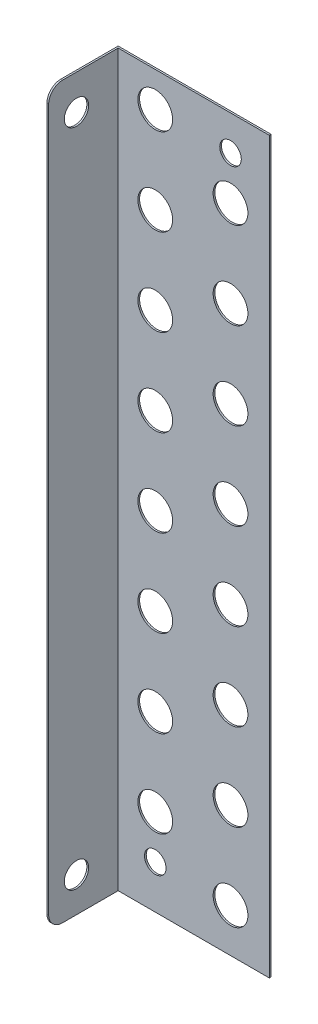
ISO-10303-21;
HEADER;
FILE_DESCRIPTION(('STEP AP214'),'2;1');
FILE_NAME('part.step','',(''),(''),'','','');
FILE_SCHEMA(('AUTOMOTIVE_DESIGN { 1 0 10303 214 1 1 1 1 }'));
ENDSEC;
DATA;
#1=APPLICATION_CONTEXT('core data for automotive mechanical design processes');
#2=APPLICATION_PROTOCOL_DEFINITION('international standard','automotive_design',2000,#1);
#3=PRODUCT_CONTEXT('',#1,'mechanical');
#4=PRODUCT('Part','Part','',(#3));
#5=PRODUCT_RELATED_PRODUCT_CATEGORY('part','',(#4));
#6=PRODUCT_DEFINITION_FORMATION('','',#4);
#7=PRODUCT_DEFINITION_CONTEXT('part definition',#1,'design');
#8=PRODUCT_DEFINITION('design','',#6,#7);
#9=PRODUCT_DEFINITION_SHAPE('','',#8);
#10=(LENGTH_UNIT() NAMED_UNIT(*) SI_UNIT(.MILLI.,.METRE.));
#11=(NAMED_UNIT(*) PLANE_ANGLE_UNIT() SI_UNIT($,.RADIAN.));
#12=(NAMED_UNIT(*) SI_UNIT($,.STERADIAN.) SOLID_ANGLE_UNIT());
#13=UNCERTAINTY_MEASURE_WITH_UNIT(LENGTH_MEASURE(1.E-05),#10,'distance_accuracy_value','');
#14=(GEOMETRIC_REPRESENTATION_CONTEXT(3) GLOBAL_UNCERTAINTY_ASSIGNED_CONTEXT((#13)) GLOBAL_UNIT_ASSIGNED_CONTEXT((#10,
#11,#12)) REPRESENTATION_CONTEXT('',''));
#15=CARTESIAN_POINT('',(0.,0.,0.));
#16=DIRECTION('',(0.,0.,1.));
#17=DIRECTION('',(1.,0.,0.));
#18=AXIS2_PLACEMENT_3D('',#15,#16,#17);
#19=CARTESIAN_POINT('',(-24.0763930717643,-5.81265666230799,17.1538176321324));
#20=DIRECTION('',(0.,0.,-1.));
#21=DIRECTION('',(-1.,0.,0.));
#22=AXIS2_PLACEMENT_3D('',#19,#20,#21);
#23=PLANE('',#22);
#24=CARTESIAN_POINT('',(-13.2510755244588,-98.312656662308,17.1538176321324));
#25=DIRECTION('',(0.,0.,1.));
#26=DIRECTION('',(1.,0.,0.));
#27=AXIS2_PLACEMENT_3D('',#24,#25,#26);
#28=CIRCLE('',#27,5.);
#29=CARTESIAN_POINT('',(-8.2510755244588,-98.312656662308,17.1538176321324));
#30=VERTEX_POINT('',#29);
#31=EDGE_CURVE('E11',#30,#30,#28,.T.);
#32=ORIENTED_EDGE('',*,*,#31,.F.);
#33=EDGE_LOOP('',(#32));
#34=FACE_BOUND('',#33,.T.);
#35=CARTESIAN_POINT('',(-13.2510755244588,-73.312656662308,17.1538176321324));
#36=DIRECTION('',(0.,0.,1.));
#37=DIRECTION('',(1.,0.,0.));
#38=AXIS2_PLACEMENT_3D('',#35,#36,#37);
#39=CIRCLE('',#38,5.);
#40=CARTESIAN_POINT('',(-8.2510755244588,-73.312656662308,17.1538176321324));
#41=VERTEX_POINT('',#40);
#42=EDGE_CURVE('E44',#41,#41,#39,.T.);
#43=ORIENTED_EDGE('',*,*,#42,.F.);
#44=EDGE_LOOP('',(#43));
#45=FACE_BOUND('',#44,.T.);
#46=CARTESIAN_POINT('',(-13.2510755244588,-48.312656662308,17.1538176321324));
#47=DIRECTION('',(0.,0.,1.));
#48=DIRECTION('',(1.,0.,0.));
#49=AXIS2_PLACEMENT_3D('',#46,#47,#48);
#50=CIRCLE('',#49,5.);
#51=CARTESIAN_POINT('',(-8.2510755244588,-48.312656662308,17.1538176321324));
#52=VERTEX_POINT('',#51);
#53=EDGE_CURVE('E145',#52,#52,#50,.T.);
#54=ORIENTED_EDGE('',*,*,#53,.F.);
#55=EDGE_LOOP('',(#54));
#56=FACE_BOUND('',#55,.T.);
#57=CARTESIAN_POINT('',(-13.2510755244588,-23.312656662308,17.1538176321324));
#58=DIRECTION('',(0.,0.,1.));
#59=DIRECTION('',(1.,0.,0.));
#60=AXIS2_PLACEMENT_3D('',#57,#58,#59);
#61=CIRCLE('',#60,5.);
#62=CARTESIAN_POINT('',(-8.2510755244588,-23.312656662308,17.1538176321324));
#63=VERTEX_POINT('',#62);
#64=EDGE_CURVE('E142',#63,#63,#61,.T.);
#65=ORIENTED_EDGE('',*,*,#64,.F.);
#66=EDGE_LOOP('',(#65));
#67=FACE_BOUND('',#66,.T.);
#68=CARTESIAN_POINT('',(-13.2510755244588,1.68734333769202,17.1538176321324));
#69=DIRECTION('',(0.,0.,1.));
#70=DIRECTION('',(1.,0.,0.));
#71=AXIS2_PLACEMENT_3D('',#68,#69,#70);
#72=CIRCLE('',#71,5.);
#73=CARTESIAN_POINT('',(-8.2510755244588,1.68734333769202,17.1538176321324));
#74=VERTEX_POINT('',#73);
#75=EDGE_CURVE('E139',#74,#74,#72,.T.);
#76=ORIENTED_EDGE('',*,*,#75,.F.);
#77=EDGE_LOOP('',(#76));
#78=FACE_BOUND('',#77,.T.);
#79=CARTESIAN_POINT('',(-13.2510755244588,26.687343337692,17.1538176321324));
#80=DIRECTION('',(0.,0.,1.));
#81=DIRECTION('',(1.,0.,0.));
#82=AXIS2_PLACEMENT_3D('',#79,#80,#81);
#83=CIRCLE('',#82,5.);
#84=CARTESIAN_POINT('',(-8.2510755244588,26.687343337692,17.1538176321324));
#85=VERTEX_POINT('',#84);
#86=EDGE_CURVE('E136',#85,#85,#83,.T.);
#87=ORIENTED_EDGE('',*,*,#86,.F.);
#88=EDGE_LOOP('',(#87));
#89=FACE_BOUND('',#88,.T.);
#90=CARTESIAN_POINT('',(-34.9017106190698,-85.812656662308,17.1538176321324));
#91=DIRECTION('',(0.,0.,1.));
#92=DIRECTION('',(1.,0.,0.));
#93=AXIS2_PLACEMENT_3D('',#90,#91,#92);
#94=CIRCLE('',#93,5.);
#95=CARTESIAN_POINT('',(-29.9017106190698,-85.812656662308,17.1538176321324));
#96=VERTEX_POINT('',#95);
#97=EDGE_CURVE('E133',#96,#96,#94,.T.);
#98=ORIENTED_EDGE('',*,*,#97,.F.);
#99=EDGE_LOOP('',(#98));
#100=FACE_BOUND('',#99,.T.);
#101=CARTESIAN_POINT('',(-34.9017106190698,-60.812656662308,17.1538176321324));
#102=DIRECTION('',(0.,0.,1.));
#103=DIRECTION('',(1.,0.,0.));
#104=AXIS2_PLACEMENT_3D('',#101,#102,#103);
#105=CIRCLE('',#104,5.);
#106=CARTESIAN_POINT('',(-29.9017106190698,-60.812656662308,17.1538176321324));
#107=VERTEX_POINT('',#106);
#108=EDGE_CURVE('E130',#107,#107,#105,.T.);
#109=ORIENTED_EDGE('',*,*,#108,.F.);
#110=EDGE_LOOP('',(#109));
#111=FACE_BOUND('',#110,.T.);
#112=CARTESIAN_POINT('',(-34.9017106190698,-35.812656662308,17.1538176321324));
#113=DIRECTION('',(0.,0.,1.));
#114=DIRECTION('',(1.,0.,0.));
#115=AXIS2_PLACEMENT_3D('',#112,#113,#114);
#116=CIRCLE('',#115,5.);
#117=CARTESIAN_POINT('',(-29.9017106190698,-35.812656662308,17.1538176321324));
#118=VERTEX_POINT('',#117);
#119=EDGE_CURVE('E127',#118,#118,#116,.T.);
#120=ORIENTED_EDGE('',*,*,#119,.F.);
#121=EDGE_LOOP('',(#120));
#122=FACE_BOUND('',#121,.T.);
#123=CARTESIAN_POINT('',(-34.9017106190698,-10.812656662308,17.1538176321324));
#124=DIRECTION('',(0.,0.,1.));
#125=DIRECTION('',(1.,0.,0.));
#126=AXIS2_PLACEMENT_3D('',#123,#124,#125);
#127=CIRCLE('',#126,5.);
#128=CARTESIAN_POINT('',(-29.9017106190698,-10.812656662308,17.1538176321324));
#129=VERTEX_POINT('',#128);
#130=EDGE_CURVE('E124',#129,#129,#127,.T.);
#131=ORIENTED_EDGE('',*,*,#130,.F.);
#132=EDGE_LOOP('',(#131));
#133=FACE_BOUND('',#132,.T.);
#134=CARTESIAN_POINT('',(-34.9017106190698,14.187343337692,17.1538176321324));
#135=DIRECTION('',(0.,0.,1.));
#136=DIRECTION('',(1.,0.,0.));
#137=AXIS2_PLACEMENT_3D('',#134,#135,#136);
#138=CIRCLE('',#137,5.);
#139=CARTESIAN_POINT('',(-29.9017106190698,14.187343337692,17.1538176321324));
#140=VERTEX_POINT('',#139);
#141=EDGE_CURVE('E121',#140,#140,#138,.T.);
#142=ORIENTED_EDGE('',*,*,#141,.F.);
#143=EDGE_LOOP('',(#142));
#144=FACE_BOUND('',#143,.T.);
#145=CARTESIAN_POINT('',(-34.9017106190698,39.187343337692,17.1538176321324));
#146=DIRECTION('',(0.,0.,1.));
#147=DIRECTION('',(1.,0.,0.));
#148=AXIS2_PLACEMENT_3D('',#145,#146,#147);
#149=CIRCLE('',#148,5.);
#150=CARTESIAN_POINT('',(-29.9017106190698,39.187343337692,17.1538176321324));
#151=VERTEX_POINT('',#150);
#152=EDGE_CURVE('E118',#151,#151,#149,.T.);
#153=ORIENTED_EDGE('',*,*,#152,.F.);
#154=EDGE_LOOP('',(#153));
#155=FACE_BOUND('',#154,.T.);
#156=CARTESIAN_POINT('',(-13.2510755244588,76.687343337692,17.1538176321324));
#157=DIRECTION('',(0.,0.,1.));
#158=DIRECTION('',(1.,0.,0.));
#159=AXIS2_PLACEMENT_3D('',#156,#157,#158);
#160=CIRCLE('',#159,5.);
#161=CARTESIAN_POINT('',(-8.2510755244588,76.687343337692,17.1538176321324));
#162=VERTEX_POINT('',#161);
#163=EDGE_CURVE('E101',#162,#162,#160,.T.);
#164=ORIENTED_EDGE('',*,*,#163,.F.);
#165=EDGE_LOOP('',(#164));
#166=FACE_BOUND('',#165,.T.);
#167=CARTESIAN_POINT('',(-34.9017106190698,89.187343337692,17.1538176321324));
#168=DIRECTION('',(0.,0.,1.));
#169=DIRECTION('',(1.,0.,0.));
#170=AXIS2_PLACEMENT_3D('',#167,#168,#169);
#171=CIRCLE('',#170,5.);
#172=CARTESIAN_POINT('',(-29.9017106190698,89.187343337692,17.1538176321324));
#173=VERTEX_POINT('',#172);
#174=EDGE_CURVE('E105',#173,#173,#171,.T.);
#175=ORIENTED_EDGE('',*,*,#174,.F.);
#176=EDGE_LOOP('',(#175));
#177=FACE_BOUND('',#176,.T.);
#178=CARTESIAN_POINT('',(-34.9017106190698,64.187343337692,17.1538176321324));
#179=DIRECTION('',(0.,0.,1.));
#180=DIRECTION('',(1.,0.,0.));
#181=AXIS2_PLACEMENT_3D('',#178,#179,#180);
#182=CIRCLE('',#181,5.);
#183=CARTESIAN_POINT('',(-29.9017106190698,64.187343337692,17.1538176321324));
#184=VERTEX_POINT('',#183);
#185=EDGE_CURVE('E158',#184,#184,#182,.T.);
#186=ORIENTED_EDGE('',*,*,#185,.F.);
#187=EDGE_LOOP('',(#186));
#188=FACE_BOUND('',#187,.T.);
#189=CARTESIAN_POINT('',(-13.2510755244588,51.687343337692,17.1538176321324));
#190=DIRECTION('',(0.,0.,1.));
#191=DIRECTION('',(1.,0.,0.));
#192=AXIS2_PLACEMENT_3D('',#189,#190,#191);
#193=CIRCLE('',#192,5.);
#194=CARTESIAN_POINT('',(-8.2510755244588,51.687343337692,17.1538176321324));
#195=VERTEX_POINT('',#194);
#196=EDGE_CURVE('E161',#195,#195,#193,.T.);
#197=ORIENTED_EDGE('',*,*,#196,.F.);
#198=EDGE_LOOP('',(#197));
#199=FACE_BOUND('',#198,.T.);
#200=CARTESIAN_POINT('',(-13.2510755244588,89.187343337692,17.1538176321324));
#201=DIRECTION('',(0.,0.,-1.));
#202=DIRECTION('',(-1.,0.,0.));
#203=AXIS2_PLACEMENT_3D('',#200,#201,#202);
#204=CIRCLE('',#203,3.1);
#205=CARTESIAN_POINT('',(-16.3510755244588,89.187343337692,17.1538176321324));
#206=VERTEX_POINT('',#205);
#207=EDGE_CURVE('E164',#206,#206,#204,.T.);
#208=ORIENTED_EDGE('',*,*,#207,.T.);
#209=EDGE_LOOP('',(#208));
#210=FACE_BOUND('',#209,.T.);
#211=CARTESIAN_POINT('',(-34.9017106190698,-98.312656662308,17.1538176321324));
#212=DIRECTION('',(0.,0.,-1.));
#213=DIRECTION('',(-1.,0.,0.));
#214=AXIS2_PLACEMENT_3D('',#211,#212,#213);
#215=CIRCLE('',#214,3.1);
#216=CARTESIAN_POINT('',(-38.0017106190698,-98.312656662308,17.1538176321324));
#217=VERTEX_POINT('',#216);
#218=EDGE_CURVE('E168',#217,#217,#215,.T.);
#219=ORIENTED_EDGE('',*,*,#218,.T.);
#220=EDGE_LOOP('',(#219));
#221=FACE_BOUND('',#220,.T.);
#222=DIRECTION('',(0.,1.,0.));
#223=VECTOR('',#222,1.);
#224=CARTESIAN_POINT('',(-45.5763930717643,0.,17.1538176321324));
#225=LINE('',#224,#223);
#226=CARTESIAN_POINT('',(-45.5763930717643,-110.812656662308,17.1538176321324));
#227=VERTEX_POINT('',#226);
#228=CARTESIAN_POINT('',(-45.5763930717643,99.187343337692,17.1538176321324));
#229=VERTEX_POINT('',#228);
#230=EDGE_CURVE('E52',#227,#229,#225,.T.);
#231=ORIENTED_EDGE('',*,*,#230,.F.);
#232=DIRECTION('',(1.,0.,0.));
#233=VECTOR('',#232,1.);
#234=CARTESIAN_POINT('',(-46.0763930717643,-110.812656662308,17.1538176321324));
#235=LINE('',#234,#233);
#236=CARTESIAN_POINT('',(-2.07639307176429,-110.812656662308,17.1538176321324));
#237=VERTEX_POINT('',#236);
#238=EDGE_CURVE('E57',#227,#237,#235,.T.);
#239=ORIENTED_EDGE('',*,*,#238,.T.);
#240=DIRECTION('',(0.,1.,0.));
#241=VECTOR('',#240,1.);
#242=CARTESIAN_POINT('',(-2.07639307176429,-110.812656662308,17.1538176321324));
#243=LINE('',#242,#241);
#244=CARTESIAN_POINT('',(-2.07639307176429,99.187343337692,17.1538176321324));
#245=VERTEX_POINT('',#244);
#246=EDGE_CURVE('E88',#237,#245,#243,.T.);
#247=ORIENTED_EDGE('',*,*,#246,.T.);
#248=DIRECTION('',(-1.,0.,0.));
#249=VECTOR('',#248,1.);
#250=CARTESIAN_POINT('',(-46.0763930717643,99.187343337692,17.1538176321324));
#251=LINE('',#250,#249);
#252=EDGE_CURVE('E150',#245,#229,#251,.T.);
#253=ORIENTED_EDGE('',*,*,#252,.T.);
#254=EDGE_LOOP('',(#231,#239,#247,#253));
#255=FACE_BOUND('',#254,.T.);
#256=ADVANCED_FACE('F35',(#34,#45,#56,#67,#78,#89,#100,#111,#122,#133,#144,#155,#166,#177,#188,
#199,#210,#221,#255),#23,.F.);
#257=CARTESIAN_POINT('',(-13.2510755244588,76.687343337692,16.6538176321324));
#258=DIRECTION('',(0.,0.,1.));
#259=DIRECTION('',(1.,0.,0.));
#260=AXIS2_PLACEMENT_3D('',#257,#258,#259);
#261=CYLINDRICAL_SURFACE('',#260,5.);
#262=ORIENTED_EDGE('',*,*,#163,.T.);
#263=EDGE_LOOP('',(#262));
#264=FACE_BOUND('',#263,.T.);
#265=CARTESIAN_POINT('',(-13.2510755244588,76.687343337692,16.6538176321324));
#266=DIRECTION('',(0.,0.,-1.));
#267=DIRECTION('',(-1.,0.,0.));
#268=AXIS2_PLACEMENT_3D('',#265,#266,#267);
#269=CIRCLE('',#268,5.);
#270=CARTESIAN_POINT('',(-18.2510755244588,76.687343337692,16.6538176321324));
#271=VERTEX_POINT('',#270);
#272=EDGE_CURVE('E174',#271,#271,#269,.F.);
#273=ORIENTED_EDGE('',*,*,#272,.F.);
#274=EDGE_LOOP('',(#273));
#275=FACE_BOUND('',#274,.T.);
#276=ADVANCED_FACE('F335',(#264,#275),#261,.F.);
#277=CARTESIAN_POINT('',(-34.9017106190698,89.187343337692,16.6538176321324));
#278=DIRECTION('',(0.,0.,1.));
#279=DIRECTION('',(1.,0.,0.));
#280=AXIS2_PLACEMENT_3D('',#277,#278,#279);
#281=CYLINDRICAL_SURFACE('',#280,5.);
#282=ORIENTED_EDGE('',*,*,#174,.T.);
#283=EDGE_LOOP('',(#282));
#284=FACE_BOUND('',#283,.T.);
#285=CARTESIAN_POINT('',(-34.9017106190698,89.187343337692,16.6538176321324));
#286=DIRECTION('',(0.,0.,-1.));
#287=DIRECTION('',(-1.,0.,0.));
#288=AXIS2_PLACEMENT_3D('',#285,#286,#287);
#289=CIRCLE('',#288,5.);
#290=CARTESIAN_POINT('',(-39.9017106190698,89.187343337692,16.6538176321324));
#291=VERTEX_POINT('',#290);
#292=EDGE_CURVE('E179',#291,#291,#289,.F.);
#293=ORIENTED_EDGE('',*,*,#292,.F.);
#294=EDGE_LOOP('',(#293));
#295=FACE_BOUND('',#294,.T.);
#296=ADVANCED_FACE('F341',(#284,#295),#281,.F.);
#297=CARTESIAN_POINT('',(-34.9017106190698,64.187343337692,16.6538176321324));
#298=DIRECTION('',(0.,0.,1.));
#299=DIRECTION('',(1.,0.,0.));
#300=AXIS2_PLACEMENT_3D('',#297,#298,#299);
#301=CYLINDRICAL_SURFACE('',#300,5.);
#302=ORIENTED_EDGE('',*,*,#185,.T.);
#303=EDGE_LOOP('',(#302));
#304=FACE_BOUND('',#303,.T.);
#305=CARTESIAN_POINT('',(-34.9017106190698,64.187343337692,16.6538176321324));
#306=DIRECTION('',(0.,0.,-1.));
#307=DIRECTION('',(-1.,0.,0.));
#308=AXIS2_PLACEMENT_3D('',#305,#306,#307);
#309=CIRCLE('',#308,5.);
#310=CARTESIAN_POINT('',(-39.9017106190698,64.187343337692,16.6538176321324));
#311=VERTEX_POINT('',#310);
#312=EDGE_CURVE('E182',#311,#311,#309,.F.);
#313=ORIENTED_EDGE('',*,*,#312,.F.);
#314=EDGE_LOOP('',(#313));
#315=FACE_BOUND('',#314,.T.);
#316=ADVANCED_FACE('F362',(#304,#315),#301,.F.);
#317=CARTESIAN_POINT('',(-34.9017106190698,39.187343337692,16.6538176321324));
#318=DIRECTION('',(0.,0.,1.));
#319=DIRECTION('',(1.,0.,0.));
#320=AXIS2_PLACEMENT_3D('',#317,#318,#319);
#321=CYLINDRICAL_SURFACE('',#320,5.);
#322=ORIENTED_EDGE('',*,*,#152,.T.);
#323=EDGE_LOOP('',(#322));
#324=FACE_BOUND('',#323,.T.);
#325=CARTESIAN_POINT('',(-34.9017106190698,39.187343337692,16.6538176321324));
#326=DIRECTION('',(0.,0.,-1.));
#327=DIRECTION('',(-1.,0.,0.));
#328=AXIS2_PLACEMENT_3D('',#325,#326,#327);
#329=CIRCLE('',#328,5.);
#330=CARTESIAN_POINT('',(-39.9017106190698,39.187343337692,16.6538176321324));
#331=VERTEX_POINT('',#330);
#332=EDGE_CURVE('E185',#331,#331,#329,.F.);
#333=ORIENTED_EDGE('',*,*,#332,.F.);
#334=EDGE_LOOP('',(#333));
#335=FACE_BOUND('',#334,.T.);
#336=ADVANCED_FACE('F358',(#324,#335),#321,.F.);
#337=CARTESIAN_POINT('',(-34.9017106190698,14.187343337692,16.6538176321324));
#338=DIRECTION('',(0.,0.,1.));
#339=DIRECTION('',(1.,0.,0.));
#340=AXIS2_PLACEMENT_3D('',#337,#338,#339);
#341=CYLINDRICAL_SURFACE('',#340,5.);
#342=ORIENTED_EDGE('',*,*,#141,.T.);
#343=EDGE_LOOP('',(#342));
#344=FACE_BOUND('',#343,.T.);
#345=CARTESIAN_POINT('',(-34.9017106190698,14.187343337692,16.6538176321324));
#346=DIRECTION('',(0.,0.,-1.));
#347=DIRECTION('',(-1.,0.,0.));
#348=AXIS2_PLACEMENT_3D('',#345,#346,#347);
#349=CIRCLE('',#348,5.);
#350=CARTESIAN_POINT('',(-39.9017106190698,14.187343337692,16.6538176321324));
#351=VERTEX_POINT('',#350);
#352=EDGE_CURVE('E188',#351,#351,#349,.F.);
#353=ORIENTED_EDGE('',*,*,#352,.F.);
#354=EDGE_LOOP('',(#353));
#355=FACE_BOUND('',#354,.T.);
#356=ADVANCED_FACE('F361',(#344,#355),#341,.F.);
#357=CARTESIAN_POINT('',(-34.9017106190698,-10.812656662308,16.6538176321324));
#358=DIRECTION('',(0.,0.,1.));
#359=DIRECTION('',(1.,0.,0.));
#360=AXIS2_PLACEMENT_3D('',#357,#358,#359);
#361=CYLINDRICAL_SURFACE('',#360,5.);
#362=ORIENTED_EDGE('',*,*,#130,.T.);
#363=EDGE_LOOP('',(#362));
#364=FACE_BOUND('',#363,.T.);
#365=CARTESIAN_POINT('',(-34.9017106190698,-10.812656662308,16.6538176321324));
#366=DIRECTION('',(0.,0.,-1.));
#367=DIRECTION('',(-1.,0.,0.));
#368=AXIS2_PLACEMENT_3D('',#365,#366,#367);
#369=CIRCLE('',#368,5.);
#370=CARTESIAN_POINT('',(-39.9017106190698,-10.812656662308,16.6538176321324));
#371=VERTEX_POINT('',#370);
#372=EDGE_CURVE('E191',#371,#371,#369,.F.);
#373=ORIENTED_EDGE('',*,*,#372,.F.);
#374=EDGE_LOOP('',(#373));
#375=FACE_BOUND('',#374,.T.);
#376=ADVANCED_FACE('F366',(#364,#375),#361,.F.);
#377=CARTESIAN_POINT('',(-34.9017106190698,-35.812656662308,16.6538176321324));
#378=DIRECTION('',(0.,0.,1.));
#379=DIRECTION('',(1.,0.,0.));
#380=AXIS2_PLACEMENT_3D('',#377,#378,#379);
#381=CYLINDRICAL_SURFACE('',#380,5.);
#382=ORIENTED_EDGE('',*,*,#119,.T.);
#383=EDGE_LOOP('',(#382));
#384=FACE_BOUND('',#383,.T.);
#385=CARTESIAN_POINT('',(-34.9017106190698,-35.812656662308,16.6538176321324));
#386=DIRECTION('',(0.,0.,-1.));
#387=DIRECTION('',(-1.,0.,0.));
#388=AXIS2_PLACEMENT_3D('',#385,#386,#387);
#389=CIRCLE('',#388,5.);
#390=CARTESIAN_POINT('',(-39.9017106190698,-35.812656662308,16.6538176321324));
#391=VERTEX_POINT('',#390);
#392=EDGE_CURVE('E194',#391,#391,#389,.F.);
#393=ORIENTED_EDGE('',*,*,#392,.F.);
#394=EDGE_LOOP('',(#393));
#395=FACE_BOUND('',#394,.T.);
#396=ADVANCED_FACE('F370',(#384,#395),#381,.F.);
#397=CARTESIAN_POINT('',(-34.9017106190698,-60.812656662308,16.6538176321324));
#398=DIRECTION('',(0.,0.,1.));
#399=DIRECTION('',(1.,0.,0.));
#400=AXIS2_PLACEMENT_3D('',#397,#398,#399);
#401=CYLINDRICAL_SURFACE('',#400,5.);
#402=ORIENTED_EDGE('',*,*,#108,.T.);
#403=EDGE_LOOP('',(#402));
#404=FACE_BOUND('',#403,.T.);
#405=CARTESIAN_POINT('',(-34.9017106190698,-60.812656662308,16.6538176321324));
#406=DIRECTION('',(0.,0.,-1.));
#407=DIRECTION('',(-1.,0.,0.));
#408=AXIS2_PLACEMENT_3D('',#405,#406,#407);
#409=CIRCLE('',#408,5.);
#410=CARTESIAN_POINT('',(-39.9017106190698,-60.812656662308,16.6538176321324));
#411=VERTEX_POINT('',#410);
#412=EDGE_CURVE('E197',#411,#411,#409,.F.);
#413=ORIENTED_EDGE('',*,*,#412,.F.);
#414=EDGE_LOOP('',(#413));
#415=FACE_BOUND('',#414,.T.);
#416=ADVANCED_FACE('F374',(#404,#415),#401,.F.);
#417=CARTESIAN_POINT('',(-34.9017106190698,-85.812656662308,16.6538176321324));
#418=DIRECTION('',(0.,0.,1.));
#419=DIRECTION('',(1.,0.,0.));
#420=AXIS2_PLACEMENT_3D('',#417,#418,#419);
#421=CYLINDRICAL_SURFACE('',#420,5.);
#422=ORIENTED_EDGE('',*,*,#97,.T.);
#423=EDGE_LOOP('',(#422));
#424=FACE_BOUND('',#423,.T.);
#425=CARTESIAN_POINT('',(-34.9017106190698,-85.812656662308,16.6538176321324));
#426=DIRECTION('',(0.,0.,-1.));
#427=DIRECTION('',(-1.,0.,0.));
#428=AXIS2_PLACEMENT_3D('',#425,#426,#427);
#429=CIRCLE('',#428,5.);
#430=CARTESIAN_POINT('',(-39.9017106190698,-85.812656662308,16.6538176321324));
#431=VERTEX_POINT('',#430);
#432=EDGE_CURVE('E200',#431,#431,#429,.F.);
#433=ORIENTED_EDGE('',*,*,#432,.F.);
#434=EDGE_LOOP('',(#433));
#435=FACE_BOUND('',#434,.T.);
#436=ADVANCED_FACE('F378',(#424,#435),#421,.F.);
#437=CARTESIAN_POINT('',(-13.2510755244588,51.687343337692,16.6538176321324));
#438=DIRECTION('',(0.,0.,1.));
#439=DIRECTION('',(1.,0.,0.));
#440=AXIS2_PLACEMENT_3D('',#437,#438,#439);
#441=CYLINDRICAL_SURFACE('',#440,5.);
#442=ORIENTED_EDGE('',*,*,#196,.T.);
#443=EDGE_LOOP('',(#442));
#444=FACE_BOUND('',#443,.T.);
#445=CARTESIAN_POINT('',(-13.2510755244588,51.687343337692,16.6538176321324));
#446=DIRECTION('',(0.,0.,-1.));
#447=DIRECTION('',(-1.,0.,0.));
#448=AXIS2_PLACEMENT_3D('',#445,#446,#447);
#449=CIRCLE('',#448,5.);
#450=CARTESIAN_POINT('',(-18.2510755244588,51.687343337692,16.6538176321324));
#451=VERTEX_POINT('',#450);
#452=EDGE_CURVE('E203',#451,#451,#449,.F.);
#453=ORIENTED_EDGE('',*,*,#452,.F.);
#454=EDGE_LOOP('',(#453));
#455=FACE_BOUND('',#454,.T.);
#456=ADVANCED_FACE('F382',(#444,#455),#441,.F.);
#457=CARTESIAN_POINT('',(-13.2510755244588,26.687343337692,16.6538176321324));
#458=DIRECTION('',(0.,0.,1.));
#459=DIRECTION('',(1.,0.,0.));
#460=AXIS2_PLACEMENT_3D('',#457,#458,#459);
#461=CYLINDRICAL_SURFACE('',#460,5.);
#462=ORIENTED_EDGE('',*,*,#86,.T.);
#463=EDGE_LOOP('',(#462));
#464=FACE_BOUND('',#463,.T.);
#465=CARTESIAN_POINT('',(-13.2510755244588,26.687343337692,16.6538176321324));
#466=DIRECTION('',(0.,0.,-1.));
#467=DIRECTION('',(-1.,0.,0.));
#468=AXIS2_PLACEMENT_3D('',#465,#466,#467);
#469=CIRCLE('',#468,5.);
#470=CARTESIAN_POINT('',(-18.2510755244588,26.687343337692,16.6538176321324));
#471=VERTEX_POINT('',#470);
#472=EDGE_CURVE('E206',#471,#471,#469,.F.);
#473=ORIENTED_EDGE('',*,*,#472,.F.);
#474=EDGE_LOOP('',(#473));
#475=FACE_BOUND('',#474,.T.);
#476=ADVANCED_FACE('F384',(#464,#475),#461,.F.);
#477=CARTESIAN_POINT('',(-13.2510755244588,1.68734333769202,16.6538176321324));
#478=DIRECTION('',(0.,0.,1.));
#479=DIRECTION('',(1.,0.,0.));
#480=AXIS2_PLACEMENT_3D('',#477,#478,#479);
#481=CYLINDRICAL_SURFACE('',#480,5.);
#482=ORIENTED_EDGE('',*,*,#75,.T.);
#483=EDGE_LOOP('',(#482));
#484=FACE_BOUND('',#483,.T.);
#485=CARTESIAN_POINT('',(-13.2510755244588,1.68734333769202,16.6538176321324));
#486=DIRECTION('',(0.,0.,-1.));
#487=DIRECTION('',(-1.,0.,0.));
#488=AXIS2_PLACEMENT_3D('',#485,#486,#487);
#489=CIRCLE('',#488,5.);
#490=CARTESIAN_POINT('',(-18.2510755244588,1.68734333769202,16.6538176321324));
#491=VERTEX_POINT('',#490);
#492=EDGE_CURVE('E209',#491,#491,#489,.F.);
#493=ORIENTED_EDGE('',*,*,#492,.F.);
#494=EDGE_LOOP('',(#493));
#495=FACE_BOUND('',#494,.T.);
#496=ADVANCED_FACE('F387',(#484,#495),#481,.F.);
#497=CARTESIAN_POINT('',(-13.2510755244588,-23.312656662308,16.6538176321324));
#498=DIRECTION('',(0.,0.,1.));
#499=DIRECTION('',(1.,0.,0.));
#500=AXIS2_PLACEMENT_3D('',#497,#498,#499);
#501=CYLINDRICAL_SURFACE('',#500,5.);
#502=ORIENTED_EDGE('',*,*,#64,.T.);
#503=EDGE_LOOP('',(#502));
#504=FACE_BOUND('',#503,.T.);
#505=CARTESIAN_POINT('',(-13.2510755244588,-23.312656662308,16.6538176321324));
#506=DIRECTION('',(0.,0.,-1.));
#507=DIRECTION('',(-1.,0.,0.));
#508=AXIS2_PLACEMENT_3D('',#505,#506,#507);
#509=CIRCLE('',#508,5.);
#510=CARTESIAN_POINT('',(-18.2510755244588,-23.312656662308,16.6538176321324));
#511=VERTEX_POINT('',#510);
#512=EDGE_CURVE('E212',#511,#511,#509,.F.);
#513=ORIENTED_EDGE('',*,*,#512,.F.);
#514=EDGE_LOOP('',(#513));
#515=FACE_BOUND('',#514,.T.);
#516=ADVANCED_FACE('F391',(#504,#515),#501,.F.);
#517=CARTESIAN_POINT('',(-13.2510755244588,-48.312656662308,16.6538176321324));
#518=DIRECTION('',(0.,0.,1.));
#519=DIRECTION('',(1.,0.,0.));
#520=AXIS2_PLACEMENT_3D('',#517,#518,#519);
#521=CYLINDRICAL_SURFACE('',#520,5.);
#522=ORIENTED_EDGE('',*,*,#53,.T.);
#523=EDGE_LOOP('',(#522));
#524=FACE_BOUND('',#523,.T.);
#525=CARTESIAN_POINT('',(-13.2510755244588,-48.312656662308,16.6538176321324));
#526=DIRECTION('',(0.,0.,-1.));
#527=DIRECTION('',(-1.,0.,0.));
#528=AXIS2_PLACEMENT_3D('',#525,#526,#527);
#529=CIRCLE('',#528,5.);
#530=CARTESIAN_POINT('',(-18.2510755244588,-48.312656662308,16.6538176321324));
#531=VERTEX_POINT('',#530);
#532=EDGE_CURVE('E215',#531,#531,#529,.F.);
#533=ORIENTED_EDGE('',*,*,#532,.F.);
#534=EDGE_LOOP('',(#533));
#535=FACE_BOUND('',#534,.T.);
#536=ADVANCED_FACE('F395',(#524,#535),#521,.F.);
#537=CARTESIAN_POINT('',(-13.2510755244588,-73.312656662308,16.6538176321324));
#538=DIRECTION('',(0.,0.,1.));
#539=DIRECTION('',(1.,0.,0.));
#540=AXIS2_PLACEMENT_3D('',#537,#538,#539);
#541=CYLINDRICAL_SURFACE('',#540,5.);
#542=ORIENTED_EDGE('',*,*,#42,.T.);
#543=EDGE_LOOP('',(#542));
#544=FACE_BOUND('',#543,.T.);
#545=CARTESIAN_POINT('',(-13.2510755244588,-73.312656662308,16.6538176321324));
#546=DIRECTION('',(0.,0.,-1.));
#547=DIRECTION('',(-1.,0.,0.));
#548=AXIS2_PLACEMENT_3D('',#545,#546,#547);
#549=CIRCLE('',#548,5.);
#550=CARTESIAN_POINT('',(-18.2510755244588,-73.312656662308,16.6538176321324));
#551=VERTEX_POINT('',#550);
#552=EDGE_CURVE('E218',#551,#551,#549,.F.);
#553=ORIENTED_EDGE('',*,*,#552,.F.);
#554=EDGE_LOOP('',(#553));
#555=FACE_BOUND('',#554,.T.);
#556=ADVANCED_FACE('F398',(#544,#555),#541,.F.);
#557=CARTESIAN_POINT('',(-13.2510755244588,-98.312656662308,16.6538176321324));
#558=DIRECTION('',(0.,0.,1.));
#559=DIRECTION('',(1.,0.,0.));
#560=AXIS2_PLACEMENT_3D('',#557,#558,#559);
#561=CYLINDRICAL_SURFACE('',#560,5.);
#562=ORIENTED_EDGE('',*,*,#31,.T.);
#563=EDGE_LOOP('',(#562));
#564=FACE_BOUND('',#563,.T.);
#565=CARTESIAN_POINT('',(-13.2510755244588,-98.312656662308,16.6538176321324));
#566=DIRECTION('',(0.,0.,-1.));
#567=DIRECTION('',(-1.,0.,0.));
#568=AXIS2_PLACEMENT_3D('',#565,#566,#567);
#569=CIRCLE('',#568,5.);
#570=CARTESIAN_POINT('',(-18.2510755244588,-98.312656662308,16.6538176321324));
#571=VERTEX_POINT('',#570);
#572=EDGE_CURVE('E221',#571,#571,#569,.F.);
#573=ORIENTED_EDGE('',*,*,#572,.F.);
#574=EDGE_LOOP('',(#573));
#575=FACE_BOUND('',#574,.T.);
#576=ADVANCED_FACE('F37',(#564,#575),#561,.F.);
#577=CARTESIAN_POINT('',(-24.0763930717643,-5.81265666230799,16.6538176321324));
#578=DIRECTION('',(0.,0.,-1.));
#579=DIRECTION('',(-1.,0.,0.));
#580=AXIS2_PLACEMENT_3D('',#577,#578,#579);
#581=PLANE('',#580);
#582=CARTESIAN_POINT('',(-34.9017106190698,-98.312656662308,16.6538176321324));
#583=DIRECTION('',(0.,0.,-1.));
#584=DIRECTION('',(-1.,0.,0.));
#585=AXIS2_PLACEMENT_3D('',#582,#583,#584);
#586=CIRCLE('',#585,3.1);
#587=CARTESIAN_POINT('',(-38.0017106190698,-98.312656662308,16.6538176321324));
#588=VERTEX_POINT('',#587);
#589=EDGE_CURVE('E171',#588,#588,#586,.T.);
#590=ORIENTED_EDGE('',*,*,#589,.F.);
#591=EDGE_LOOP('',(#590));
#592=FACE_BOUND('',#591,.T.);
#593=CARTESIAN_POINT('',(-13.2510755244588,89.187343337692,16.6538176321324));
#594=DIRECTION('',(0.,0.,-1.));
#595=DIRECTION('',(-1.,0.,0.));
#596=AXIS2_PLACEMENT_3D('',#593,#594,#595);
#597=CIRCLE('',#596,3.1);
#598=CARTESIAN_POINT('',(-16.3510755244588,89.187343337692,16.6538176321324));
#599=VERTEX_POINT('',#598);
#600=EDGE_CURVE('E165',#599,#599,#597,.T.);
#601=ORIENTED_EDGE('',*,*,#600,.F.);
#602=EDGE_LOOP('',(#601));
#603=FACE_BOUND('',#602,.T.);
#604=DIRECTION('',(0.,1.,0.));
#605=VECTOR('',#604,1.);
#606=CARTESIAN_POINT('',(-2.07639307176429,-110.812656662308,16.6538176321324));
#607=LINE('',#606,#605);
#608=CARTESIAN_POINT('',(-2.07639307176429,-110.812656662308,16.6538176321324));
#609=VERTEX_POINT('',#608);
#610=CARTESIAN_POINT('',(-2.07639307176429,99.187343337692,16.6538176321324));
#611=VERTEX_POINT('',#610);
#612=EDGE_CURVE('E95',#609,#611,#607,.T.);
#613=ORIENTED_EDGE('',*,*,#612,.F.);
#614=DIRECTION('',(1.,0.,0.));
#615=VECTOR('',#614,1.);
#616=CARTESIAN_POINT('',(-46.0763930717643,-110.812656662308,16.6538176321324));
#617=LINE('',#616,#615);
#618=CARTESIAN_POINT('',(-46.0763930717643,-110.812656662308,16.6538176321324));
#619=VERTEX_POINT('',#618);
#620=EDGE_CURVE('E77',#619,#609,#617,.T.);
#621=ORIENTED_EDGE('',*,*,#620,.F.);
#622=DIRECTION('',(0.,-1.,0.));
#623=VECTOR('',#622,1.);
#624=CARTESIAN_POINT('',(-46.0763930717643,-110.812656662308,16.6538176321324));
#625=LINE('',#624,#623);
#626=CARTESIAN_POINT('',(-46.0763930717643,99.187343337692,16.6538176321324));
#627=VERTEX_POINT('',#626);
#628=EDGE_CURVE('E89',#627,#619,#625,.T.);
#629=ORIENTED_EDGE('',*,*,#628,.F.);
#630=DIRECTION('',(-1.,0.,0.));
#631=VECTOR('',#630,1.);
#632=CARTESIAN_POINT('',(-46.0763930717643,99.187343337692,16.6538176321324));
#633=LINE('',#632,#631);
#634=EDGE_CURVE('E99',#611,#627,#633,.T.);
#635=ORIENTED_EDGE('',*,*,#634,.F.);
#636=EDGE_LOOP('',(#613,#621,#629,#635));
#637=FACE_BOUND('',#636,.T.);
#638=ORIENTED_EDGE('',*,*,#272,.T.);
#639=EDGE_LOOP('',(#638));
#640=FACE_BOUND('',#639,.T.);
#641=ORIENTED_EDGE('',*,*,#292,.T.);
#642=EDGE_LOOP('',(#641));
#643=FACE_BOUND('',#642,.T.);
#644=ORIENTED_EDGE('',*,*,#452,.T.);
#645=EDGE_LOOP('',(#644));
#646=FACE_BOUND('',#645,.T.);
#647=ORIENTED_EDGE('',*,*,#312,.T.);
#648=EDGE_LOOP('',(#647));
#649=FACE_BOUND('',#648,.T.);
#650=ORIENTED_EDGE('',*,*,#472,.T.);
#651=EDGE_LOOP('',(#650));
#652=FACE_BOUND('',#651,.T.);
#653=ORIENTED_EDGE('',*,*,#332,.T.);
#654=EDGE_LOOP('',(#653));
#655=FACE_BOUND('',#654,.T.);
#656=ORIENTED_EDGE('',*,*,#492,.T.);
#657=EDGE_LOOP('',(#656));
#658=FACE_BOUND('',#657,.T.);
#659=ORIENTED_EDGE('',*,*,#352,.T.);
#660=EDGE_LOOP('',(#659));
#661=FACE_BOUND('',#660,.T.);
#662=ORIENTED_EDGE('',*,*,#512,.T.);
#663=EDGE_LOOP('',(#662));
#664=FACE_BOUND('',#663,.T.);
#665=ORIENTED_EDGE('',*,*,#372,.T.);
#666=EDGE_LOOP('',(#665));
#667=FACE_BOUND('',#666,.T.);
#668=ORIENTED_EDGE('',*,*,#532,.T.);
#669=EDGE_LOOP('',(#668));
#670=FACE_BOUND('',#669,.T.);
#671=ORIENTED_EDGE('',*,*,#392,.T.);
#672=EDGE_LOOP('',(#671));
#673=FACE_BOUND('',#672,.T.);
#674=ORIENTED_EDGE('',*,*,#552,.T.);
#675=EDGE_LOOP('',(#674));
#676=FACE_BOUND('',#675,.T.);
#677=ORIENTED_EDGE('',*,*,#412,.T.);
#678=EDGE_LOOP('',(#677));
#679=FACE_BOUND('',#678,.T.);
#680=ORIENTED_EDGE('',*,*,#572,.T.);
#681=EDGE_LOOP('',(#680));
#682=FACE_BOUND('',#681,.T.);
#683=ORIENTED_EDGE('',*,*,#432,.T.);
#684=EDGE_LOOP('',(#683));
#685=FACE_BOUND('',#684,.T.);
#686=ADVANCED_FACE('F97',(#592,#603,#637,#640,#643,#646,#649,#652,#655,#658,#661,#664,#667,#670,
#673,#676,#679,#682,#685),#581,.T.);
#687=CARTESIAN_POINT('',(-2.07639307176429,-110.812656662308,17.1538176321324));
#688=DIRECTION('',(-1.,0.,0.));
#689=DIRECTION('',(0.,0.,1.));
#690=AXIS2_PLACEMENT_3D('',#687,#688,#689);
#691=PLANE('',#690);
#692=ORIENTED_EDGE('',*,*,#612,.T.);
#693=DIRECTION('',(0.,0.,-1.));
#694=VECTOR('',#693,1.);
#695=CARTESIAN_POINT('',(-2.07639307176429,99.187343337692,17.1538176321324));
#696=LINE('',#695,#694);
#697=EDGE_CURVE('E116',#245,#611,#696,.T.);
#698=ORIENTED_EDGE('',*,*,#697,.F.);
#699=ORIENTED_EDGE('',*,*,#246,.F.);
#700=DIRECTION('',(0.,0.,-1.));
#701=VECTOR('',#700,1.);
#702=CARTESIAN_POINT('',(-2.07639307176429,-110.812656662308,17.1538176321324));
#703=LINE('',#702,#701);
#704=EDGE_CURVE('E80',#237,#609,#703,.T.);
#705=ORIENTED_EDGE('',*,*,#704,.T.);
#706=EDGE_LOOP('',(#692,#698,#699,#705));
#707=FACE_BOUND('',#706,.T.);
#708=ADVANCED_FACE('F93',(#707),#691,.F.);
#709=CARTESIAN_POINT('',(-46.0763930717643,99.187343337692,17.1538176321324));
#710=DIRECTION('',(0.,-1.,0.));
#711=DIRECTION('',(0.,0.,-1.));
#712=AXIS2_PLACEMENT_3D('',#709,#710,#711);
#713=PLANE('',#712);
#714=ORIENTED_EDGE('',*,*,#634,.T.);
#715=DIRECTION('',(0.,0.,-1.));
#716=VECTOR('',#715,1.);
#717=CARTESIAN_POINT('',(-46.0763930717643,99.187343337692,17.1538176321324));
#718=LINE('',#717,#716);
#719=CARTESIAN_POINT('',(-46.0763930717643,99.187343337692,33.1538176321324));
#720=VERTEX_POINT('',#719);
#721=EDGE_CURVE('E113',#720,#627,#718,.T.);
#722=ORIENTED_EDGE('',*,*,#721,.F.);
#723=DIRECTION('',(-1.,0.,0.));
#724=VECTOR('',#723,1.);
#725=CARTESIAN_POINT('',(-45.5763930717643,99.187343337692,33.1538176321324));
#726=LINE('',#725,#724);
#727=CARTESIAN_POINT('',(-45.5763930717643,99.187343337692,33.1538176321324));
#728=VERTEX_POINT('',#727);
#729=EDGE_CURVE('E225',#728,#720,#726,.T.);
#730=ORIENTED_EDGE('',*,*,#729,.F.);
#731=DIRECTION('',(0.,0.,1.));
#732=VECTOR('',#731,1.);
#733=CARTESIAN_POINT('',(-45.5763930717643,99.187343337692,0.));
#734=LINE('',#733,#732);
#735=EDGE_CURVE('E267',#229,#728,#734,.T.);
#736=ORIENTED_EDGE('',*,*,#735,.F.);
#737=ORIENTED_EDGE('',*,*,#252,.F.);
#738=ORIENTED_EDGE('',*,*,#697,.T.);
#739=EDGE_LOOP('',(#714,#722,#730,#736,#737,#738));
#740=FACE_BOUND('',#739,.T.);
#741=ADVANCED_FACE('F307',(#740),#713,.F.);
#742=CARTESIAN_POINT('',(-46.0763930717643,-110.812656662308,17.1538176321324));
#743=DIRECTION('',(1.,0.,0.));
#744=DIRECTION('',(0.,0.,-1.));
#745=AXIS2_PLACEMENT_3D('',#742,#743,#744);
#746=PLANE('',#745);
#747=ORIENTED_EDGE('',*,*,#628,.T.);
#748=DIRECTION('',(0.,0.,-1.));
#749=VECTOR('',#748,1.);
#750=CARTESIAN_POINT('',(-46.0763930717643,-110.812656662308,17.1538176321324));
#751=LINE('',#750,#749);
#752=CARTESIAN_POINT('',(-46.0763930717643,-110.812656662308,33.1538176321324));
#753=VERTEX_POINT('',#752);
#754=EDGE_CURVE('E84',#753,#619,#751,.T.);
#755=ORIENTED_EDGE('',*,*,#754,.F.);
#756=CARTESIAN_POINT('',(-46.0763930717643,-106.812656662308,33.1538176321324));
#757=DIRECTION('',(-1.,0.,0.));
#758=DIRECTION('',(0.,0.,1.));
#759=AXIS2_PLACEMENT_3D('',#756,#757,#758);
#760=CIRCLE('',#759,4.00000000000001);
#761=CARTESIAN_POINT('',(-46.0763930717643,-106.812656662308,37.1538176321324));
#762=VERTEX_POINT('',#761);
#763=EDGE_CURVE('E246',#753,#762,#760,.T.);
#764=ORIENTED_EDGE('',*,*,#763,.T.);
#765=DIRECTION('',(0.,-1.,0.));
#766=VECTOR('',#765,1.);
#767=CARTESIAN_POINT('',(-46.0763930717643,0.,37.1538176321324));
#768=LINE('',#767,#766);
#769=CARTESIAN_POINT('',(-46.0763930717643,95.187343337692,37.1538176321324));
#770=VERTEX_POINT('',#769);
#771=EDGE_CURVE('E243',#770,#762,#768,.T.);
#772=ORIENTED_EDGE('',*,*,#771,.F.);
#773=CARTESIAN_POINT('',(-46.0763930717643,95.187343337692,33.1538176321324));
#774=DIRECTION('',(-1.,0.,0.));
#775=DIRECTION('',(0.,0.,1.));
#776=AXIS2_PLACEMENT_3D('',#773,#774,#775);
#777=CIRCLE('',#776,4.);
#778=EDGE_CURVE('E249',#720,#770,#777,.F.);
#779=ORIENTED_EDGE('',*,*,#778,.F.);
#780=ORIENTED_EDGE('',*,*,#721,.T.);
#781=EDGE_LOOP('',(#747,#755,#764,#772,#779,#780));
#782=FACE_BOUND('',#781,.T.);
#783=CARTESIAN_POINT('',(-46.0763930717643,89.187343337692,29.1538176321324));
#784=DIRECTION('',(-1.,0.,0.));
#785=DIRECTION('',(0.,0.,1.));
#786=AXIS2_PLACEMENT_3D('',#783,#784,#785);
#787=CIRCLE('',#786,3.49999999999999);
#788=CARTESIAN_POINT('',(-46.0763930717643,89.187343337692,32.6538176321324));
#789=VERTEX_POINT('',#788);
#790=EDGE_CURVE('E240',#789,#789,#787,.T.);
#791=ORIENTED_EDGE('',*,*,#790,.F.);
#792=EDGE_LOOP('',(#791));
#793=FACE_BOUND('',#792,.T.);
#794=CARTESIAN_POINT('',(-46.0763930717643,-100.812656662308,29.1538176321324));
#795=DIRECTION('',(-1.,0.,0.));
#796=DIRECTION('',(0.,0.,1.));
#797=AXIS2_PLACEMENT_3D('',#794,#795,#796);
#798=CIRCLE('',#797,3.5);
#799=CARTESIAN_POINT('',(-46.0763930717643,-100.812656662308,32.6538176321324));
#800=VERTEX_POINT('',#799);
#801=EDGE_CURVE('E236',#800,#800,#798,.F.);
#802=ORIENTED_EDGE('',*,*,#801,.T.);
#803=EDGE_LOOP('',(#802));
#804=FACE_BOUND('',#803,.T.);
#805=ADVANCED_FACE('F314',(#782,#793,#804),#746,.F.);
#806=CARTESIAN_POINT('',(-46.0763930717643,-110.812656662308,17.1538176321324));
#807=DIRECTION('',(0.,1.,0.));
#808=DIRECTION('',(0.,0.,1.));
#809=AXIS2_PLACEMENT_3D('',#806,#807,#808);
#810=PLANE('',#809);
#811=ORIENTED_EDGE('',*,*,#620,.T.);
#812=ORIENTED_EDGE('',*,*,#704,.F.);
#813=ORIENTED_EDGE('',*,*,#238,.F.);
#814=DIRECTION('',(0.,0.,1.));
#815=VECTOR('',#814,1.);
#816=CARTESIAN_POINT('',(-45.5763930717643,-110.812656662308,0.));
#817=LINE('',#816,#815);
#818=CARTESIAN_POINT('',(-45.5763930717643,-110.812656662308,33.1538176321324));
#819=VERTEX_POINT('',#818);
#820=EDGE_CURVE('E263',#227,#819,#817,.T.);
#821=ORIENTED_EDGE('',*,*,#820,.T.);
#822=DIRECTION('',(-1.,0.,0.));
#823=VECTOR('',#822,1.);
#824=CARTESIAN_POINT('',(-45.5763930717643,-110.812656662308,33.1538176321324));
#825=LINE('',#824,#823);
#826=EDGE_CURVE('E228',#819,#753,#825,.T.);
#827=ORIENTED_EDGE('',*,*,#826,.T.);
#828=ORIENTED_EDGE('',*,*,#754,.T.);
#829=EDGE_LOOP('',(#811,#812,#813,#821,#827,#828));
#830=FACE_BOUND('',#829,.T.);
#831=ADVANCED_FACE('F79',(#830),#810,.F.);
#832=CARTESIAN_POINT('',(-13.2510755244588,89.187343337692,17.1538176321324));
#833=DIRECTION('',(0.,0.,-1.));
#834=DIRECTION('',(-1.,0.,0.));
#835=AXIS2_PLACEMENT_3D('',#832,#833,#834);
#836=CYLINDRICAL_SURFACE('',#835,3.1);
#837=ORIENTED_EDGE('',*,*,#207,.F.);
#838=EDGE_LOOP('',(#837));
#839=FACE_BOUND('',#838,.T.);
#840=ORIENTED_EDGE('',*,*,#600,.T.);
#841=EDGE_LOOP('',(#840));
#842=FACE_BOUND('',#841,.T.);
#843=ADVANCED_FACE('F352',(#839,#842),#836,.F.);
#844=CARTESIAN_POINT('',(-34.9017106190698,-98.312656662308,17.1538176321324));
#845=DIRECTION('',(0.,0.,-1.));
#846=DIRECTION('',(-1.,0.,0.));
#847=AXIS2_PLACEMENT_3D('',#844,#845,#846);
#848=CYLINDRICAL_SURFACE('',#847,3.1);
#849=ORIENTED_EDGE('',*,*,#218,.F.);
#850=EDGE_LOOP('',(#849));
#851=FACE_BOUND('',#850,.T.);
#852=ORIENTED_EDGE('',*,*,#589,.T.);
#853=EDGE_LOOP('',(#852));
#854=FACE_BOUND('',#853,.T.);
#855=ADVANCED_FACE('F452',(#851,#854),#848,.F.);
#856=CARTESIAN_POINT('',(-45.5763930717643,95.187343337692,33.1538176321324));
#857=DIRECTION('',(-1.,0.,0.));
#858=DIRECTION('',(0.,0.,1.));
#859=AXIS2_PLACEMENT_3D('',#856,#857,#858);
#860=CYLINDRICAL_SURFACE('',#859,4.);
#861=ORIENTED_EDGE('',*,*,#778,.T.);
#862=DIRECTION('',(-1.,0.,0.));
#863=VECTOR('',#862,1.);
#864=CARTESIAN_POINT('',(-45.5763930717643,95.187343337692,37.1538176321324));
#865=LINE('',#864,#863);
#866=CARTESIAN_POINT('',(-45.5763930717643,95.187343337692,37.1538176321324));
#867=VERTEX_POINT('',#866);
#868=EDGE_CURVE('E224',#867,#770,#865,.T.);
#869=ORIENTED_EDGE('',*,*,#868,.F.);
#870=CARTESIAN_POINT('',(-45.5763930717643,95.187343337692,33.1538176321324));
#871=DIRECTION('',(-1.,0.,0.));
#872=DIRECTION('',(0.,0.,1.));
#873=AXIS2_PLACEMENT_3D('',#870,#871,#872);
#874=CIRCLE('',#873,4.);
#875=EDGE_CURVE('E239',#728,#867,#874,.F.);
#876=ORIENTED_EDGE('',*,*,#875,.F.);
#877=ORIENTED_EDGE('',*,*,#729,.T.);
#878=EDGE_LOOP('',(#861,#869,#876,#877));
#879=FACE_BOUND('',#878,.T.);
#880=ADVANCED_FACE('F311',(#879),#860,.T.);
#881=CARTESIAN_POINT('',(-45.5763930717643,0.,37.1538176321324));
#882=DIRECTION('',(0.,0.,-1.));
#883=DIRECTION('',(0.,1.,0.));
#884=AXIS2_PLACEMENT_3D('',#881,#882,#883);
#885=PLANE('',#884);
#886=ORIENTED_EDGE('',*,*,#771,.T.);
#887=DIRECTION('',(-1.,0.,0.));
#888=VECTOR('',#887,1.);
#889=CARTESIAN_POINT('',(-45.5763930717643,-106.812656662308,37.1538176321324));
#890=LINE('',#889,#888);
#891=CARTESIAN_POINT('',(-45.5763930717643,-106.812656662308,37.1538176321324));
#892=VERTEX_POINT('',#891);
#893=EDGE_CURVE('E231',#892,#762,#890,.T.);
#894=ORIENTED_EDGE('',*,*,#893,.F.);
#895=DIRECTION('',(0.,-1.,0.));
#896=VECTOR('',#895,1.);
#897=CARTESIAN_POINT('',(-45.5763930717643,0.,37.1538176321324));
#898=LINE('',#897,#896);
#899=EDGE_CURVE('E257',#867,#892,#898,.T.);
#900=ORIENTED_EDGE('',*,*,#899,.F.);
#901=ORIENTED_EDGE('',*,*,#868,.T.);
#902=EDGE_LOOP('',(#886,#894,#900,#901));
#903=FACE_BOUND('',#902,.T.);
#904=ADVANCED_FACE('F313',(#903),#885,.F.);
#905=CARTESIAN_POINT('',(-45.5763930717643,-106.812656662308,33.1538176321324));
#906=DIRECTION('',(-1.,0.,0.));
#907=DIRECTION('',(0.,0.,1.));
#908=AXIS2_PLACEMENT_3D('',#905,#906,#907);
#909=CYLINDRICAL_SURFACE('',#908,4.00000000000001);
#910=ORIENTED_EDGE('',*,*,#763,.F.);
#911=ORIENTED_EDGE('',*,*,#826,.F.);
#912=CARTESIAN_POINT('',(-45.5763930717643,-106.812656662308,33.1538176321324));
#913=DIRECTION('',(-1.,0.,0.));
#914=DIRECTION('',(0.,0.,1.));
#915=AXIS2_PLACEMENT_3D('',#912,#913,#914);
#916=CIRCLE('',#915,4.00000000000001);
#917=EDGE_CURVE('E260',#819,#892,#916,.T.);
#918=ORIENTED_EDGE('',*,*,#917,.T.);
#919=ORIENTED_EDGE('',*,*,#893,.T.);
#920=EDGE_LOOP('',(#910,#911,#918,#919));
#921=FACE_BOUND('',#920,.T.);
#922=ADVANCED_FACE('F289',(#921),#909,.T.);
#923=CARTESIAN_POINT('',(-45.5763930717643,89.187343337692,29.1538176321324));
#924=DIRECTION('',(-1.,0.,0.));
#925=DIRECTION('',(0.,0.,1.));
#926=AXIS2_PLACEMENT_3D('',#923,#924,#925);
#927=CYLINDRICAL_SURFACE('',#926,3.49999999999999);
#928=CARTESIAN_POINT('',(-45.5763930717643,89.187343337692,29.1538176321324));
#929=DIRECTION('',(-1.,0.,0.));
#930=DIRECTION('',(0.,0.,1.));
#931=AXIS2_PLACEMENT_3D('',#928,#929,#930);
#932=CIRCLE('',#931,3.49999999999999);
#933=CARTESIAN_POINT('',(-45.5763930717643,89.187343337692,32.6538176321324));
#934=VERTEX_POINT('',#933);
#935=EDGE_CURVE('E254',#934,#934,#932,.T.);
#936=ORIENTED_EDGE('',*,*,#935,.F.);
#937=EDGE_LOOP('',(#936));
#938=FACE_BOUND('',#937,.T.);
#939=ORIENTED_EDGE('',*,*,#790,.T.);
#940=EDGE_LOOP('',(#939));
#941=FACE_BOUND('',#940,.T.);
#942=ADVANCED_FACE('F324',(#938,#941),#927,.F.);
#943=CARTESIAN_POINT('',(-45.5763930717643,-100.812656662308,29.1538176321324));
#944=DIRECTION('',(-1.,0.,0.));
#945=DIRECTION('',(0.,0.,1.));
#946=AXIS2_PLACEMENT_3D('',#943,#944,#945);
#947=CYLINDRICAL_SURFACE('',#946,3.5);
#948=CARTESIAN_POINT('',(-45.5763930717643,-100.812656662308,29.1538176321324));
#949=DIRECTION('',(-1.,0.,0.));
#950=DIRECTION('',(0.,0.,1.));
#951=AXIS2_PLACEMENT_3D('',#948,#949,#950);
#952=CIRCLE('',#951,3.5);
#953=CARTESIAN_POINT('',(-45.5763930717643,-100.812656662308,32.6538176321324));
#954=VERTEX_POINT('',#953);
#955=EDGE_CURVE('E229',#954,#954,#952,.F.);
#956=ORIENTED_EDGE('',*,*,#955,.T.);
#957=EDGE_LOOP('',(#956));
#958=FACE_BOUND('',#957,.T.);
#959=ORIENTED_EDGE('',*,*,#801,.F.);
#960=EDGE_LOOP('',(#959));
#961=FACE_BOUND('',#960,.T.);
#962=ADVANCED_FACE('F322',(#958,#961),#947,.F.);
#963=CARTESIAN_POINT('',(-45.5763930717643,0.,0.));
#964=DIRECTION('',(-1.,0.,0.));
#965=DIRECTION('',(0.,0.,1.));
#966=AXIS2_PLACEMENT_3D('',#963,#964,#965);
#967=PLANE('',#966);
#968=ORIENTED_EDGE('',*,*,#875,.T.);
#969=ORIENTED_EDGE('',*,*,#899,.T.);
#970=ORIENTED_EDGE('',*,*,#917,.F.);
#971=ORIENTED_EDGE('',*,*,#820,.F.);
#972=ORIENTED_EDGE('',*,*,#230,.T.);
#973=ORIENTED_EDGE('',*,*,#735,.T.);
#974=EDGE_LOOP('',(#968,#969,#970,#971,#972,#973));
#975=FACE_BOUND('',#974,.T.);
#976=ORIENTED_EDGE('',*,*,#935,.T.);
#977=EDGE_LOOP('',(#976));
#978=FACE_BOUND('',#977,.T.);
#979=ORIENTED_EDGE('',*,*,#955,.F.);
#980=EDGE_LOOP('',(#979));
#981=FACE_BOUND('',#980,.T.);
#982=ADVANCED_FACE('F283',(#975,#978,#981),#967,.F.);
#983=CLOSED_SHELL('',(#256,#276,#296,#316,#336,#356,#376,#396,#416,#436,#456,#476,#496,#516,
#536,#556,#576,#686,#708,#741,#805,#831,#843,#855,#880,#904,#922,#942,#962,#982));
#984=MANIFOLD_SOLID_BREP('B2',#983);
#985=ADVANCED_BREP_SHAPE_REPRESENTATION('',(#18,#984),#14);
#986=SHAPE_DEFINITION_REPRESENTATION(#9,#985);
ENDSEC;
END-ISO-10303-21;
